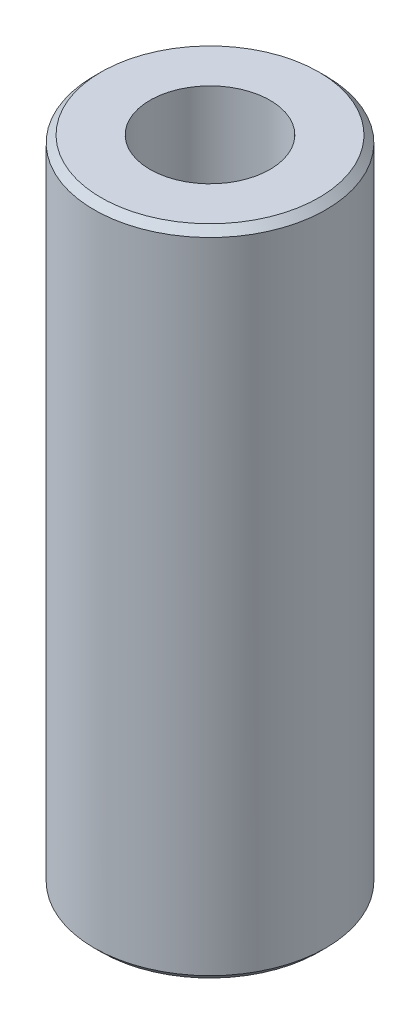
ISO-10303-21;
HEADER;
FILE_DESCRIPTION(('STEP AP214'),'2;1');
FILE_NAME('part.step','',(''),(''),'','','');
FILE_SCHEMA(('AUTOMOTIVE_DESIGN { 1 0 10303 214 1 1 1 1 }'));
ENDSEC;
DATA;
#1=APPLICATION_CONTEXT('core data for automotive mechanical design processes');
#2=APPLICATION_PROTOCOL_DEFINITION('international standard','automotive_design',2000,#1);
#3=PRODUCT_CONTEXT('',#1,'mechanical');
#4=PRODUCT('Part','Part','',(#3));
#5=PRODUCT_RELATED_PRODUCT_CATEGORY('part','',(#4));
#6=PRODUCT_DEFINITION_FORMATION('','',#4);
#7=PRODUCT_DEFINITION_CONTEXT('part definition',#1,'design');
#8=PRODUCT_DEFINITION('design','',#6,#7);
#9=PRODUCT_DEFINITION_SHAPE('','',#8);
#10=(LENGTH_UNIT() NAMED_UNIT(*) SI_UNIT(.MILLI.,.METRE.));
#11=(NAMED_UNIT(*) PLANE_ANGLE_UNIT() SI_UNIT($,.RADIAN.));
#12=(NAMED_UNIT(*) SI_UNIT($,.STERADIAN.) SOLID_ANGLE_UNIT());
#13=UNCERTAINTY_MEASURE_WITH_UNIT(LENGTH_MEASURE(1.E-05),#10,'distance_accuracy_value','');
#14=(GEOMETRIC_REPRESENTATION_CONTEXT(3) GLOBAL_UNCERTAINTY_ASSIGNED_CONTEXT((#13)) GLOBAL_UNIT_ASSIGNED_CONTEXT((#10,
#11,#12)) REPRESENTATION_CONTEXT('',''));
#15=CARTESIAN_POINT('',(0.,0.,0.));
#16=DIRECTION('',(0.,0.,1.));
#17=DIRECTION('',(1.,0.,0.));
#18=AXIS2_PLACEMENT_3D('',#15,#16,#17);
#19=CARTESIAN_POINT('',(0.,295.942166493624,0.));
#20=DIRECTION('',(0.,-1.,0.));
#21=DIRECTION('',(0.,0.,-1.));
#22=AXIS2_PLACEMENT_3D('',#19,#20,#21);
#23=CYLINDRICAL_SURFACE('',#22,52.5);
#24=CARTESIAN_POINT('',(0.,292.775386932308,0.));
#25=DIRECTION('',(0.,1.,0.));
#26=DIRECTION('',(0.,0.,1.));
#27=AXIS2_PLACEMENT_3D('',#24,#25,#26);
#28=CIRCLE('',#27,52.5);
#29=CARTESIAN_POINT('',(0.,292.775386932308,-52.5));
#30=VERTEX_POINT('',#29);
#31=EDGE_CURVE('E50',#30,#30,#28,.F.);
#32=ORIENTED_EDGE('',*,*,#31,.T.);
#33=EDGE_LOOP('',(#32));
#34=FACE_BOUND('',#33,.T.);
#35=CARTESIAN_POINT('',(0.,3.16677956131606,0.));
#36=DIRECTION('',(0.,1.,0.));
#37=DIRECTION('',(0.,0.,1.));
#38=AXIS2_PLACEMENT_3D('',#35,#36,#37);
#39=CIRCLE('',#38,52.5);
#40=CARTESIAN_POINT('',(0.,3.16677956131606,52.5));
#41=VERTEX_POINT('',#40);
#42=EDGE_CURVE('E51',#41,#41,#39,.T.);
#43=ORIENTED_EDGE('',*,*,#42,.T.);
#44=EDGE_LOOP('',(#43));
#45=FACE_BOUND('',#44,.T.);
#46=ADVANCED_FACE('F39',(#34,#45),#23,.T.);
#47=CARTESIAN_POINT('',(0.,295.942166493624,0.));
#48=DIRECTION('',(0.,1.,0.));
#49=DIRECTION('',(0.,0.,1.));
#50=AXIS2_PLACEMENT_3D('',#47,#48,#49);
#51=PLANE('',#50);
#52=CARTESIAN_POINT('',(0.,295.942166493624,0.));
#53=DIRECTION('',(0.,1.,0.));
#54=DIRECTION('',(0.,0.,1.));
#55=AXIS2_PLACEMENT_3D('',#52,#53,#54);
#56=CIRCLE('',#55,49.3332204386838);
#57=CARTESIAN_POINT('',(0.,295.942166493624,-49.3332204386839));
#58=VERTEX_POINT('',#57);
#59=EDGE_CURVE('E54',#58,#58,#56,.T.);
#60=ORIENTED_EDGE('',*,*,#59,.T.);
#61=EDGE_LOOP('',(#60));
#62=FACE_BOUND('',#61,.T.);
#63=CARTESIAN_POINT('',(0.,295.942166493624,0.));
#64=DIRECTION('',(0.,1.,0.));
#65=DIRECTION('',(0.,0.,1.));
#66=AXIS2_PLACEMENT_3D('',#63,#64,#65);
#67=CIRCLE('',#66,27.1837219611552);
#68=CARTESIAN_POINT('',(0.,295.942166493624,27.1837219611552));
#69=VERTEX_POINT('',#68);
#70=EDGE_CURVE('E58',#69,#69,#67,.T.);
#71=ORIENTED_EDGE('',*,*,#70,.F.);
#72=EDGE_LOOP('',(#71));
#73=FACE_BOUND('',#72,.T.);
#74=ADVANCED_FACE('F69',(#62,#73),#51,.T.);
#75=CARTESIAN_POINT('',(0.,0.,0.));
#76=DIRECTION('',(0.,1.,0.));
#77=DIRECTION('',(0.,0.,1.));
#78=AXIS2_PLACEMENT_3D('',#75,#76,#77);
#79=PLANE('',#78);
#80=CARTESIAN_POINT('',(0.,0.,0.));
#81=DIRECTION('',(0.,1.,0.));
#82=DIRECTION('',(0.,0.,1.));
#83=AXIS2_PLACEMENT_3D('',#80,#81,#82);
#84=CIRCLE('',#83,49.3332204386839);
#85=CARTESIAN_POINT('',(0.,0.,49.3332204386839));
#86=VERTEX_POINT('',#85);
#87=EDGE_CURVE('E10',#86,#86,#84,.F.);
#88=ORIENTED_EDGE('',*,*,#87,.T.);
#89=EDGE_LOOP('',(#88));
#90=FACE_BOUND('',#89,.T.);
#91=CARTESIAN_POINT('',(0.,0.,0.));
#92=DIRECTION('',(0.,1.,0.));
#93=DIRECTION('',(0.,0.,1.));
#94=AXIS2_PLACEMENT_3D('',#91,#92,#93);
#95=CIRCLE('',#94,27.1837219611552);
#96=CARTESIAN_POINT('',(0.,0.,27.1837219611552));
#97=VERTEX_POINT('',#96);
#98=EDGE_CURVE('E63',#97,#97,#95,.T.);
#99=ORIENTED_EDGE('',*,*,#98,.T.);
#100=EDGE_LOOP('',(#99));
#101=FACE_BOUND('',#100,.T.);
#102=ADVANCED_FACE('F75',(#90,#101),#79,.F.);
#103=CARTESIAN_POINT('',(0.,295.942166493624,0.));
#104=DIRECTION('',(0.,-1.,0.));
#105=DIRECTION('',(0.,0.,-1.));
#106=AXIS2_PLACEMENT_3D('',#103,#104,#105);
#107=CYLINDRICAL_SURFACE('',#106,27.1837219611552);
#108=ORIENTED_EDGE('',*,*,#70,.T.);
#109=EDGE_LOOP('',(#108));
#110=FACE_BOUND('',#109,.T.);
#111=ORIENTED_EDGE('',*,*,#98,.F.);
#112=EDGE_LOOP('',(#111));
#113=FACE_BOUND('',#112,.T.);
#114=ADVANCED_FACE('F70',(#110,#113),#107,.F.);
#115=CARTESIAN_POINT('',(0.,295.942166493624,0.));
#116=DIRECTION('',(0.,-1.,0.));
#117=DIRECTION('',(0.,0.,-1.));
#118=AXIS2_PLACEMENT_3D('',#115,#116,#117);
#119=CONICAL_SURFACE('',#118,49.3332204386838,0.785398163397449);
#120=CARTESIAN_POINT('',(0.,292.775386932308,-52.5));
#121=CARTESIAN_POINT('',(0.,292.808374219405,-52.467012712903));
#122=CARTESIAN_POINT('',(0.,292.841361506502,-52.4340254258059));
#123=CARTESIAN_POINT('',(0.,292.907336080696,-52.3680508516118));
#124=CARTESIAN_POINT('',(0.,292.940323367793,-52.3350635645148));
#125=CARTESIAN_POINT('',(0.,293.006297941987,-52.2690889903207));
#126=CARTESIAN_POINT('',(0.,293.039285229084,-52.2361017032237));
#127=CARTESIAN_POINT('',(0.,293.105259803278,-52.1701271290296));
#128=CARTESIAN_POINT('',(0.,293.138247090375,-52.1371398419325));
#129=CARTESIAN_POINT('',(0.,293.20422166457,-52.0711652677385));
#130=CARTESIAN_POINT('',(0.,293.237208951667,-52.0381779806414));
#131=CARTESIAN_POINT('',(0.,293.303183525861,-51.9722034064473));
#132=CARTESIAN_POINT('',(0.,293.336170812958,-51.9392161193503));
#133=CARTESIAN_POINT('',(0.,293.402145387152,-51.8732415451562));
#134=CARTESIAN_POINT('',(0.,293.435132674249,-51.8402542580592));
#135=CARTESIAN_POINT('',(0.,293.501107248443,-51.7742796838651));
#136=CARTESIAN_POINT('',(0.,293.53409453554,-51.741292396768));
#137=CARTESIAN_POINT('',(0.,293.600069109734,-51.6753178225739));
#138=CARTESIAN_POINT('',(0.,293.633056396831,-51.6423305354769));
#139=CARTESIAN_POINT('',(0.,293.699030971025,-51.5763559612828));
#140=CARTESIAN_POINT('',(0.,293.732018258122,-51.5433686741858));
#141=CARTESIAN_POINT('',(0.,293.797992832316,-51.4773940999917));
#142=CARTESIAN_POINT('',(0.,293.830980119413,-51.4444068128946));
#143=CARTESIAN_POINT('',(0.,293.896954693607,-51.3784322387006));
#144=CARTESIAN_POINT('',(0.,293.929941980704,-51.3454449516035));
#145=CARTESIAN_POINT('',(0.,293.995916554899,-51.2794703774094));
#146=CARTESIAN_POINT('',(0.,294.028903841996,-51.2464830903124));
#147=CARTESIAN_POINT('',(0.,294.09487841619,-51.1805085161183));
#148=CARTESIAN_POINT('',(0.,294.127865703287,-51.1475212290212));
#149=CARTESIAN_POINT('',(0.,294.193840277481,-51.0815466548272));
#150=CARTESIAN_POINT('',(0.,294.226827564578,-51.0485593677301));
#151=CARTESIAN_POINT('',(0.,294.292802138772,-50.982584793536));
#152=CARTESIAN_POINT('',(0.,294.325789425869,-50.949597506439));
#153=CARTESIAN_POINT('',(0.,294.391764000063,-50.8836229322449));
#154=CARTESIAN_POINT('',(0.,294.42475128716,-50.8506356451479));
#155=CARTESIAN_POINT('',(0.,294.490725861354,-50.7846610709538));
#156=CARTESIAN_POINT('',(0.,294.523713148451,-50.7516737838567));
#157=CARTESIAN_POINT('',(0.,294.589687722645,-50.6856992096626));
#158=CARTESIAN_POINT('',(0.,294.622675009742,-50.6527119225656));
#159=CARTESIAN_POINT('',(0.,294.688649583936,-50.5867373483715));
#160=CARTESIAN_POINT('',(0.,294.721636871033,-50.5537500612744));
#161=CARTESIAN_POINT('',(0.,294.787611445228,-50.4877754870804));
#162=CARTESIAN_POINT('',(0.,294.820598732325,-50.4547881999833));
#163=CARTESIAN_POINT('',(0.,294.886573306519,-50.3888136257892));
#164=CARTESIAN_POINT('',(0.,294.919560593616,-50.3558263386922));
#165=CARTESIAN_POINT('',(0.,294.98553516781,-50.2898517644981));
#166=CARTESIAN_POINT('',(0.,295.018522454907,-50.2568644774011));
#167=CARTESIAN_POINT('',(0.,295.084497029101,-50.190889903207));
#168=CARTESIAN_POINT('',(0.,295.117484316198,-50.1579026161099));
#169=CARTESIAN_POINT('',(0.,295.183458890392,-50.0919280419159));
#170=CARTESIAN_POINT('',(0.,295.216446177489,-50.0589407548188));
#171=CARTESIAN_POINT('',(0.,295.282420751683,-49.9929661806247));
#172=CARTESIAN_POINT('',(0.,295.31540803878,-49.9599788935277));
#173=CARTESIAN_POINT('',(0.,295.381382612974,-49.8940043193336));
#174=CARTESIAN_POINT('',(0.,295.414369900071,-49.8610170322365));
#175=CARTESIAN_POINT('',(0.,295.480344474266,-49.7950424580425));
#176=CARTESIAN_POINT('',(0.,295.513331761363,-49.7620551709454));
#177=CARTESIAN_POINT('',(0.,295.579306335557,-49.6960805967513));
#178=CARTESIAN_POINT('',(0.,295.612293622654,-49.6630933096543));
#179=CARTESIAN_POINT('',(0.,295.678268196848,-49.5971187354602));
#180=CARTESIAN_POINT('',(0.,295.711255483945,-49.5641314483632));
#181=CARTESIAN_POINT('',(0.,295.777230058139,-49.4981568741691));
#182=CARTESIAN_POINT('',(0.,295.810217345236,-49.465169587072));
#183=CARTESIAN_POINT('',(0.,295.87619191943,-49.3991950128779));
#184=CARTESIAN_POINT('',(0.,295.909179206527,-49.3662077257809));
#185=CARTESIAN_POINT('',(0.,295.942166493624,-49.3332204386839));
#186=B_SPLINE_CURVE_WITH_KNOTS('',3,(#120,#121,#122,#123,#124,#125,#126,#127,#128,#129,#130,
#131,#132,#133,#134,#135,#136,#137,#138,#139,#140,#141,#142,#143,#144,#145,#146,#147,#148,#149,
#150,#151,#152,#153,#154,#155,#156,#157,#158,#159,#160,#161,#162,#163,#164,#165,#166,#167,#168,
#169,#170,#171,#172,#173,#174,#175,#176,#177,#178,#179,#180,#181,#182,#183,#184,#185),
.UNSPECIFIED.,.F.,.F.,(4,2,2,2,2,2,2,2,2,2,2,2,2,2,2,2,2,2,2,2,2,2,2,2,2,2,2,2,2,2,2,2,4),(0.,
0.139953206395621,0.279906412791203,0.419859619186824,0.559812825582406,0.699766031978027,
0.839719238373609,0.97967244476923,1.11962565116481,1.25957885756043,1.39953206395601,
1.53948527035164,1.67943847674726,1.81939168314284,1.95934488953842,2.09929809593404,
2.23925130232962,2.37920450872524,2.51915771512083,2.65911092151645,2.79906412791203,
2.93901733430765,3.07897054070324,3.21892374709886,3.35887695349448,3.49883015989006,
3.63878336628568,3.77873657268126,3.91868977907688,4.05864298547247,4.19859619186809,
4.33854939826367,4.47850260465929),.UNSPECIFIED.);
#187=EDGE_CURVE('BSEAM81',#30,#58,#186,.T.);
#188=ORIENTED_EDGE('',*,*,#31,.F.);
#189=ORIENTED_EDGE('',*,*,#59,.F.);
#190=ORIENTED_EDGE('',*,*,#187,.T.);
#191=ORIENTED_EDGE('',*,*,#187,.F.);
#192=EDGE_LOOP('',(#188,#190,#189,#191));
#193=FACE_BOUND('',#192,.T.);
#194=ADVANCED_FACE('F81',(#193),#119,.T.);
#195=CARTESIAN_POINT('',(0.,3.16677956131606,0.));
#196=DIRECTION('',(0.,1.,0.));
#197=DIRECTION('',(0.,0.,1.));
#198=AXIS2_PLACEMENT_3D('',#195,#196,#197);
#199=CONICAL_SURFACE('',#198,52.5,0.785398163397454);
#200=ORIENTED_EDGE('',*,*,#87,.F.);
#201=EDGE_LOOP('',(#200));
#202=FACE_BOUND('',#201,.T.);
#203=ORIENTED_EDGE('',*,*,#42,.F.);
#204=EDGE_LOOP('',(#203));
#205=FACE_BOUND('',#204,.T.);
#206=ADVANCED_FACE('F45',(#202,#205),#199,.T.);
#207=CLOSED_SHELL('',(#46,#74,#102,#114,#194,#206));
#208=MANIFOLD_SOLID_BREP('B2',#207);
#209=ADVANCED_BREP_SHAPE_REPRESENTATION('',(#18,#208),#14);
#210=SHAPE_DEFINITION_REPRESENTATION(#9,#209);
ENDSEC;
END-ISO-10303-21;
